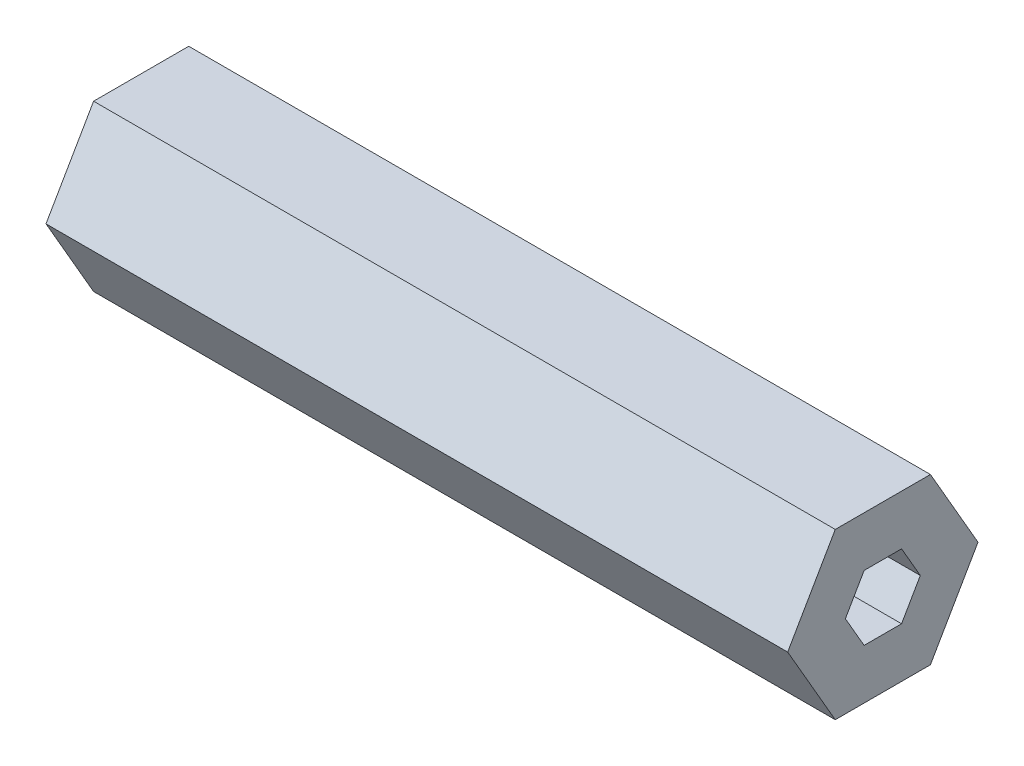
ISO-10303-21;
HEADER;
FILE_DESCRIPTION(('STEP AP214'),'2;1');
FILE_NAME('part.step','',(''),(''),'','','');
FILE_SCHEMA(('AUTOMOTIVE_DESIGN { 1 0 10303 214 1 1 1 1 }'));
ENDSEC;
DATA;
#1=APPLICATION_CONTEXT('core data for automotive mechanical design processes');
#2=APPLICATION_PROTOCOL_DEFINITION('international standard','automotive_design',2000,#1);
#3=PRODUCT_CONTEXT('',#1,'mechanical');
#4=PRODUCT('Part','Part','',(#3));
#5=PRODUCT_RELATED_PRODUCT_CATEGORY('part','',(#4));
#6=PRODUCT_DEFINITION_FORMATION('','',#4);
#7=PRODUCT_DEFINITION_CONTEXT('part definition',#1,'design');
#8=PRODUCT_DEFINITION('design','',#6,#7);
#9=PRODUCT_DEFINITION_SHAPE('','',#8);
#10=(LENGTH_UNIT() NAMED_UNIT(*) SI_UNIT(.MILLI.,.METRE.));
#11=(NAMED_UNIT(*) PLANE_ANGLE_UNIT() SI_UNIT($,.RADIAN.));
#12=(NAMED_UNIT(*) SI_UNIT($,.STERADIAN.) SOLID_ANGLE_UNIT());
#13=UNCERTAINTY_MEASURE_WITH_UNIT(LENGTH_MEASURE(1.E-05),#10,'distance_accuracy_value','');
#14=(GEOMETRIC_REPRESENTATION_CONTEXT(3) GLOBAL_UNCERTAINTY_ASSIGNED_CONTEXT((#13)) GLOBAL_UNIT_ASSIGNED_CONTEXT((#10,
#11,#12)) REPRESENTATION_CONTEXT('',''));
#15=CARTESIAN_POINT('',(0.,0.,0.));
#16=DIRECTION('',(0.,0.,1.));
#17=DIRECTION('',(1.,0.,0.));
#18=AXIS2_PLACEMENT_3D('',#15,#16,#17);
#19=CARTESIAN_POINT('',(57.15,0.,0.));
#20=DIRECTION('',(1.,0.,0.));
#21=DIRECTION('',(0.,0.,-1.));
#22=AXIS2_PLACEMENT_3D('',#19,#20,#21);
#23=PLANE('',#22);
#24=DIRECTION('',(0.,0.866025403784441,-0.499999999999995));
#25=VECTOR('',#24,1.);
#26=CARTESIAN_POINT('',(57.15,-6.34999999999996,-3.6661742093542));
#27=LINE('',#26,#25);
#28=CARTESIAN_POINT('',(57.15,-6.34999999999996,-3.6661742093542));
#29=VERTEX_POINT('',#28);
#30=CARTESIAN_POINT('',(57.15,0.,-7.33234841870825));
#31=VERTEX_POINT('',#30);
#32=EDGE_CURVE('E230',#29,#31,#27,.T.);
#33=ORIENTED_EDGE('',*,*,#32,.T.);
#34=DIRECTION('',(0.,0.866025403784438,0.500000000000001));
#35=VECTOR('',#34,1.);
#36=CARTESIAN_POINT('',(57.15,0.,-7.33234841870825));
#37=LINE('',#36,#35);
#38=CARTESIAN_POINT('',(57.15,6.35000000000001,-3.66617420935411));
#39=VERTEX_POINT('',#38);
#40=EDGE_CURVE('E234',#31,#39,#37,.T.);
#41=ORIENTED_EDGE('',*,*,#40,.T.);
#42=DIRECTION('',(0.,0.,1.));
#43=VECTOR('',#42,1.);
#44=CARTESIAN_POINT('',(57.15,6.35000000000001,-3.66617420935411));
#45=LINE('',#44,#43);
#46=CARTESIAN_POINT('',(57.15,6.34999999999999,3.66617420935416));
#47=VERTEX_POINT('',#46);
#48=EDGE_CURVE('E238',#39,#47,#45,.T.);
#49=ORIENTED_EDGE('',*,*,#48,.T.);
#50=DIRECTION('',(0.,-0.866025403784442,0.499999999999995));
#51=VECTOR('',#50,1.);
#52=CARTESIAN_POINT('',(57.15,6.34999999999999,3.66617420935416));
#53=LINE('',#52,#51);
#54=CARTESIAN_POINT('',(57.15,0.,7.33234841870825));
#55=VERTEX_POINT('',#54);
#56=EDGE_CURVE('E241',#47,#55,#53,.T.);
#57=ORIENTED_EDGE('',*,*,#56,.T.);
#58=DIRECTION('',(0.,-0.866025403784435,-0.500000000000007));
#59=VECTOR('',#58,1.);
#60=CARTESIAN_POINT('',(57.15,0.,7.33234841870825));
#61=LINE('',#60,#59);
#62=CARTESIAN_POINT('',(57.15,-6.35000000000004,3.66617420935407));
#63=VERTEX_POINT('',#62);
#64=EDGE_CURVE('E244',#55,#63,#61,.T.);
#65=ORIENTED_EDGE('',*,*,#64,.T.);
#66=DIRECTION('',(0.,0.,-1.));
#67=VECTOR('',#66,1.);
#68=CARTESIAN_POINT('',(57.15,-6.35000000000004,3.66617420935407));
#69=LINE('',#68,#67);
#70=EDGE_CURVE('E247',#63,#29,#69,.T.);
#71=ORIENTED_EDGE('',*,*,#70,.T.);
#72=EDGE_LOOP('',(#33,#41,#49,#57,#65,#71));
#73=FACE_BOUND('',#72,.T.);
#74=DIRECTION('',(0.,0.866025403784438,0.5));
#75=VECTOR('',#74,1.);
#76=CARTESIAN_POINT('',(57.15,0.,-2.88675134594813));
#77=LINE('',#76,#75);
#78=CARTESIAN_POINT('',(57.15,0.,-2.88675134594813));
#79=VERTEX_POINT('',#78);
#80=CARTESIAN_POINT('',(57.15,2.5,-1.44337567297406));
#81=VERTEX_POINT('',#80);
#82=EDGE_CURVE('E170',#79,#81,#77,.T.);
#83=ORIENTED_EDGE('',*,*,#82,.F.);
#84=DIRECTION('',(0.,0.866025403784439,-0.5));
#85=VECTOR('',#84,1.);
#86=CARTESIAN_POINT('',(57.15,-2.5,-1.44337567297407));
#87=LINE('',#86,#85);
#88=CARTESIAN_POINT('',(57.15,-2.5,-1.44337567297407));
#89=VERTEX_POINT('',#88);
#90=EDGE_CURVE('E161',#89,#79,#87,.T.);
#91=ORIENTED_EDGE('',*,*,#90,.F.);
#92=DIRECTION('',(0.,0.,-1.));
#93=VECTOR('',#92,1.);
#94=CARTESIAN_POINT('',(57.15,-2.5,1.44337567297406));
#95=LINE('',#94,#93);
#96=CARTESIAN_POINT('',(57.15,-2.5,1.44337567297406));
#97=VERTEX_POINT('',#96);
#98=EDGE_CURVE('E196',#97,#89,#95,.T.);
#99=ORIENTED_EDGE('',*,*,#98,.F.);
#100=DIRECTION('',(0.,-0.866025403784438,-0.5));
#101=VECTOR('',#100,1.);
#102=CARTESIAN_POINT('',(57.15,0.,2.88675134594813));
#103=LINE('',#102,#101);
#104=CARTESIAN_POINT('',(57.15,0.,2.88675134594813));
#105=VERTEX_POINT('',#104);
#106=EDGE_CURVE('E193',#105,#97,#103,.T.);
#107=ORIENTED_EDGE('',*,*,#106,.F.);
#108=DIRECTION('',(0.,-0.866025403784439,0.5));
#109=VECTOR('',#108,1.);
#110=CARTESIAN_POINT('',(57.15,2.5,1.44337567297406));
#111=LINE('',#110,#109);
#112=CARTESIAN_POINT('',(57.15,2.5,1.44337567297406));
#113=VERTEX_POINT('',#112);
#114=EDGE_CURVE('E188',#113,#105,#111,.T.);
#115=ORIENTED_EDGE('',*,*,#114,.F.);
#116=DIRECTION('',(0.,0.,1.));
#117=VECTOR('',#116,1.);
#118=CARTESIAN_POINT('',(57.15,2.5,-1.44337567297406));
#119=LINE('',#118,#117);
#120=EDGE_CURVE('E184',#81,#113,#119,.T.);
#121=ORIENTED_EDGE('',*,*,#120,.F.);
#122=EDGE_LOOP('',(#83,#91,#99,#107,#115,#121));
#123=FACE_BOUND('',#122,.T.);
#124=ADVANCED_FACE('F47',(#73,#123),#23,.T.);
#125=CARTESIAN_POINT('',(0.,0.,0.));
#126=DIRECTION('',(1.,0.,0.));
#127=DIRECTION('',(0.,0.,-1.));
#128=AXIS2_PLACEMENT_3D('',#125,#126,#127);
#129=PLANE('',#128);
#130=DIRECTION('',(0.,0.866025403784441,-0.499999999999995));
#131=VECTOR('',#130,1.);
#132=CARTESIAN_POINT('',(0.,-6.34999999999996,-3.6661742093542));
#133=LINE('',#132,#131);
#134=CARTESIAN_POINT('',(0.,-6.34999999999996,-3.6661742093542));
#135=VERTEX_POINT('',#134);
#136=CARTESIAN_POINT('',(0.,0.,-7.33234841870825));
#137=VERTEX_POINT('',#136);
#138=EDGE_CURVE('E179',#135,#137,#133,.T.);
#139=ORIENTED_EDGE('',*,*,#138,.F.);
#140=DIRECTION('',(0.,0.,-1.));
#141=VECTOR('',#140,1.);
#142=CARTESIAN_POINT('',(0.,-6.35000000000004,3.66617420935407));
#143=LINE('',#142,#141);
#144=CARTESIAN_POINT('',(0.,-6.35000000000004,3.66617420935407));
#145=VERTEX_POINT('',#144);
#146=EDGE_CURVE('E235',#145,#135,#143,.T.);
#147=ORIENTED_EDGE('',*,*,#146,.F.);
#148=DIRECTION('',(0.,-0.866025403784435,-0.500000000000007));
#149=VECTOR('',#148,1.);
#150=CARTESIAN_POINT('',(0.,0.,7.33234841870825));
#151=LINE('',#150,#149);
#152=CARTESIAN_POINT('',(0.,0.,7.33234841870825));
#153=VERTEX_POINT('',#152);
#154=EDGE_CURVE('E263',#153,#145,#151,.T.);
#155=ORIENTED_EDGE('',*,*,#154,.F.);
#156=DIRECTION('',(0.,-0.866025403784442,0.499999999999995));
#157=VECTOR('',#156,1.);
#158=CARTESIAN_POINT('',(0.,6.34999999999999,3.66617420935416));
#159=LINE('',#158,#157);
#160=CARTESIAN_POINT('',(0.,6.34999999999999,3.66617420935416));
#161=VERTEX_POINT('',#160);
#162=EDGE_CURVE('E260',#161,#153,#159,.T.);
#163=ORIENTED_EDGE('',*,*,#162,.F.);
#164=DIRECTION('',(0.,0.,1.));
#165=VECTOR('',#164,1.);
#166=CARTESIAN_POINT('',(0.,6.35000000000001,-3.66617420935411));
#167=LINE('',#166,#165);
#168=CARTESIAN_POINT('',(0.,6.35000000000001,-3.66617420935411));
#169=VERTEX_POINT('',#168);
#170=EDGE_CURVE('E257',#169,#161,#167,.T.);
#171=ORIENTED_EDGE('',*,*,#170,.F.);
#172=DIRECTION('',(0.,0.866025403784438,0.500000000000001));
#173=VECTOR('',#172,1.);
#174=CARTESIAN_POINT('',(0.,0.,-7.33234841870825));
#175=LINE('',#174,#173);
#176=EDGE_CURVE('E254',#137,#169,#175,.T.);
#177=ORIENTED_EDGE('',*,*,#176,.F.);
#178=EDGE_LOOP('',(#139,#147,#155,#163,#171,#177));
#179=FACE_BOUND('',#178,.T.);
#180=DIRECTION('',(0.,0.866025403784439,-0.5));
#181=VECTOR('',#180,1.);
#182=CARTESIAN_POINT('',(0.,-2.5,-1.44337567297407));
#183=LINE('',#182,#181);
#184=CARTESIAN_POINT('',(0.,-2.5,-1.44337567297407));
#185=VERTEX_POINT('',#184);
#186=CARTESIAN_POINT('',(0.,0.,-2.88675134594813));
#187=VERTEX_POINT('',#186);
#188=EDGE_CURVE('E77',#185,#187,#183,.T.);
#189=ORIENTED_EDGE('',*,*,#188,.T.);
#190=DIRECTION('',(0.,0.866025403784438,0.5));
#191=VECTOR('',#190,1.);
#192=CARTESIAN_POINT('',(0.,0.,-2.88675134594813));
#193=LINE('',#192,#191);
#194=CARTESIAN_POINT('',(0.,2.5,-1.44337567297406));
#195=VERTEX_POINT('',#194);
#196=EDGE_CURVE('E177',#187,#195,#193,.T.);
#197=ORIENTED_EDGE('',*,*,#196,.T.);
#198=DIRECTION('',(0.,0.,1.));
#199=VECTOR('',#198,1.);
#200=CARTESIAN_POINT('',(0.,2.5,-1.44337567297406));
#201=LINE('',#200,#199);
#202=CARTESIAN_POINT('',(0.,2.5,1.44337567297406));
#203=VERTEX_POINT('',#202);
#204=EDGE_CURVE('E203',#195,#203,#201,.T.);
#205=ORIENTED_EDGE('',*,*,#204,.T.);
#206=DIRECTION('',(0.,-0.866025403784439,0.5));
#207=VECTOR('',#206,1.);
#208=CARTESIAN_POINT('',(0.,2.5,1.44337567297406));
#209=LINE('',#208,#207);
#210=CARTESIAN_POINT('',(0.,0.,2.88675134594813));
#211=VERTEX_POINT('',#210);
#212=EDGE_CURVE('E207',#203,#211,#209,.T.);
#213=ORIENTED_EDGE('',*,*,#212,.T.);
#214=DIRECTION('',(0.,-0.866025403784438,-0.5));
#215=VECTOR('',#214,1.);
#216=CARTESIAN_POINT('',(0.,0.,2.88675134594813));
#217=LINE('',#216,#215);
#218=CARTESIAN_POINT('',(0.,-2.5,1.44337567297406));
#219=VERTEX_POINT('',#218);
#220=EDGE_CURVE('E211',#211,#219,#217,.T.);
#221=ORIENTED_EDGE('',*,*,#220,.T.);
#222=DIRECTION('',(0.,0.,-1.));
#223=VECTOR('',#222,1.);
#224=CARTESIAN_POINT('',(0.,-2.5,1.44337567297406));
#225=LINE('',#224,#223);
#226=EDGE_CURVE('E171',#219,#185,#225,.T.);
#227=ORIENTED_EDGE('',*,*,#226,.T.);
#228=EDGE_LOOP('',(#189,#197,#205,#213,#221,#227));
#229=FACE_BOUND('',#228,.T.);
#230=ADVANCED_FACE('F294',(#179,#229),#129,.F.);
#231=CARTESIAN_POINT('',(57.15,-6.34999999999996,-3.6661742093542));
#232=DIRECTION('',(0.,0.499999999999995,0.866025403784442));
#233=DIRECTION('',(0.,-0.866025403784442,0.499999999999995));
#234=AXIS2_PLACEMENT_3D('',#231,#232,#233);
#235=PLANE('',#234);
#236=ORIENTED_EDGE('',*,*,#138,.T.);
#237=DIRECTION('',(-1.,0.,0.));
#238=VECTOR('',#237,1.);
#239=CARTESIAN_POINT('',(57.15,0.,-7.33234841870825));
#240=LINE('',#239,#238);
#241=EDGE_CURVE('E11',#31,#137,#240,.T.);
#242=ORIENTED_EDGE('',*,*,#241,.F.);
#243=ORIENTED_EDGE('',*,*,#32,.F.);
#244=DIRECTION('',(-1.,0.,0.));
#245=VECTOR('',#244,1.);
#246=CARTESIAN_POINT('',(57.15,-6.34999999999996,-3.6661742093542));
#247=LINE('',#246,#245);
#248=EDGE_CURVE('E250',#29,#135,#247,.T.);
#249=ORIENTED_EDGE('',*,*,#248,.T.);
#250=EDGE_LOOP('',(#236,#242,#243,#249));
#251=FACE_BOUND('',#250,.T.);
#252=ADVANCED_FACE('F49',(#251),#235,.F.);
#253=CARTESIAN_POINT('',(57.15,0.,-7.33234841870825));
#254=DIRECTION('',(0.,-0.500000000000001,0.866025403784438));
#255=DIRECTION('',(0.,-0.866025403784438,-0.500000000000001));
#256=AXIS2_PLACEMENT_3D('',#253,#254,#255);
#257=PLANE('',#256);
#258=ORIENTED_EDGE('',*,*,#176,.T.);
#259=DIRECTION('',(-1.,0.,0.));
#260=VECTOR('',#259,1.);
#261=CARTESIAN_POINT('',(57.15,6.35000000000001,-3.66617420935411));
#262=LINE('',#261,#260);
#263=EDGE_CURVE('E56',#39,#169,#262,.T.);
#264=ORIENTED_EDGE('',*,*,#263,.F.);
#265=ORIENTED_EDGE('',*,*,#40,.F.);
#266=ORIENTED_EDGE('',*,*,#241,.T.);
#267=EDGE_LOOP('',(#258,#264,#265,#266));
#268=FACE_BOUND('',#267,.T.);
#269=ADVANCED_FACE('F311',(#268),#257,.F.);
#270=CARTESIAN_POINT('',(57.15,6.35000000000001,-3.66617420935411));
#271=DIRECTION('',(0.,-1.,0.));
#272=DIRECTION('',(0.,0.,-1.));
#273=AXIS2_PLACEMENT_3D('',#270,#271,#272);
#274=PLANE('',#273);
#275=ORIENTED_EDGE('',*,*,#170,.T.);
#276=DIRECTION('',(-1.,0.,0.));
#277=VECTOR('',#276,1.);
#278=CARTESIAN_POINT('',(57.15,6.34999999999999,3.66617420935416));
#279=LINE('',#278,#277);
#280=EDGE_CURVE('E279',#47,#161,#279,.T.);
#281=ORIENTED_EDGE('',*,*,#280,.F.);
#282=ORIENTED_EDGE('',*,*,#48,.F.);
#283=ORIENTED_EDGE('',*,*,#263,.T.);
#284=EDGE_LOOP('',(#275,#281,#282,#283));
#285=FACE_BOUND('',#284,.T.);
#286=ADVANCED_FACE('F288',(#285),#274,.F.);
#287=CARTESIAN_POINT('',(57.15,6.34999999999999,3.66617420935416));
#288=DIRECTION('',(0.,-0.499999999999995,-0.866025403784442));
#289=DIRECTION('',(0.,0.866025403784442,-0.499999999999995));
#290=AXIS2_PLACEMENT_3D('',#287,#288,#289);
#291=PLANE('',#290);
#292=ORIENTED_EDGE('',*,*,#162,.T.);
#293=DIRECTION('',(-1.,0.,0.));
#294=VECTOR('',#293,1.);
#295=CARTESIAN_POINT('',(57.15,0.,7.33234841870825));
#296=LINE('',#295,#294);
#297=EDGE_CURVE('E275',#55,#153,#296,.T.);
#298=ORIENTED_EDGE('',*,*,#297,.F.);
#299=ORIENTED_EDGE('',*,*,#56,.F.);
#300=ORIENTED_EDGE('',*,*,#280,.T.);
#301=EDGE_LOOP('',(#292,#298,#299,#300));
#302=FACE_BOUND('',#301,.T.);
#303=ADVANCED_FACE('F300',(#302),#291,.F.);
#304=CARTESIAN_POINT('',(57.15,0.,7.33234841870825));
#305=DIRECTION('',(0.,0.500000000000007,-0.866025403784435));
#306=DIRECTION('',(0.,0.866025403784435,0.500000000000007));
#307=AXIS2_PLACEMENT_3D('',#304,#305,#306);
#308=PLANE('',#307);
#309=ORIENTED_EDGE('',*,*,#154,.T.);
#310=DIRECTION('',(-1.,0.,0.));
#311=VECTOR('',#310,1.);
#312=CARTESIAN_POINT('',(57.15,-6.35000000000004,3.66617420935407));
#313=LINE('',#312,#311);
#314=EDGE_CURVE('E271',#63,#145,#313,.T.);
#315=ORIENTED_EDGE('',*,*,#314,.F.);
#316=ORIENTED_EDGE('',*,*,#64,.F.);
#317=ORIENTED_EDGE('',*,*,#297,.T.);
#318=EDGE_LOOP('',(#309,#315,#316,#317));
#319=FACE_BOUND('',#318,.T.);
#320=ADVANCED_FACE('F304',(#319),#308,.F.);
#321=CARTESIAN_POINT('',(57.15,-6.35000000000004,3.66617420935407));
#322=DIRECTION('',(0.,1.,0.));
#323=DIRECTION('',(0.,0.,1.));
#324=AXIS2_PLACEMENT_3D('',#321,#322,#323);
#325=PLANE('',#324);
#326=ORIENTED_EDGE('',*,*,#146,.T.);
#327=ORIENTED_EDGE('',*,*,#248,.F.);
#328=ORIENTED_EDGE('',*,*,#70,.F.);
#329=ORIENTED_EDGE('',*,*,#314,.T.);
#330=EDGE_LOOP('',(#326,#327,#328,#329));
#331=FACE_BOUND('',#330,.T.);
#332=ADVANCED_FACE('F314',(#331),#325,.F.);
#333=CARTESIAN_POINT('',(57.15,-2.5,-1.44337567297407));
#334=DIRECTION('',(0.,0.5,0.866025403784439));
#335=DIRECTION('',(0.,-0.866025403784439,0.5));
#336=AXIS2_PLACEMENT_3D('',#333,#334,#335);
#337=PLANE('',#336);
#338=ORIENTED_EDGE('',*,*,#188,.F.);
#339=DIRECTION('',(-1.,0.,0.));
#340=VECTOR('',#339,1.);
#341=CARTESIAN_POINT('',(57.15,-2.5,-1.44337567297407));
#342=LINE('',#341,#340);
#343=EDGE_CURVE('E165',#89,#185,#342,.T.);
#344=ORIENTED_EDGE('',*,*,#343,.F.);
#345=ORIENTED_EDGE('',*,*,#90,.T.);
#346=DIRECTION('',(-1.,0.,0.));
#347=VECTOR('',#346,1.);
#348=CARTESIAN_POINT('',(57.15,0.,-2.88675134594813));
#349=LINE('',#348,#347);
#350=EDGE_CURVE('E164',#79,#187,#349,.T.);
#351=ORIENTED_EDGE('',*,*,#350,.T.);
#352=EDGE_LOOP('',(#338,#344,#345,#351));
#353=FACE_BOUND('',#352,.T.);
#354=ADVANCED_FACE('F163',(#353),#337,.T.);
#355=CARTESIAN_POINT('',(57.15,0.,-2.88675134594813));
#356=DIRECTION('',(0.,-0.5,0.866025403784438));
#357=DIRECTION('',(0.,-0.866025403784439,-0.5));
#358=AXIS2_PLACEMENT_3D('',#355,#356,#357);
#359=PLANE('',#358);
#360=ORIENTED_EDGE('',*,*,#196,.F.);
#361=ORIENTED_EDGE('',*,*,#350,.F.);
#362=ORIENTED_EDGE('',*,*,#82,.T.);
#363=DIRECTION('',(-1.,0.,0.));
#364=VECTOR('',#363,1.);
#365=CARTESIAN_POINT('',(57.15,2.5,-1.44337567297406));
#366=LINE('',#365,#364);
#367=EDGE_CURVE('E180',#81,#195,#366,.T.);
#368=ORIENTED_EDGE('',*,*,#367,.T.);
#369=EDGE_LOOP('',(#360,#361,#362,#368));
#370=FACE_BOUND('',#369,.T.);
#371=ADVANCED_FACE('F174',(#370),#359,.T.);
#372=CARTESIAN_POINT('',(57.15,2.5,-1.44337567297406));
#373=DIRECTION('',(0.,-1.,0.));
#374=DIRECTION('',(0.,0.,-1.));
#375=AXIS2_PLACEMENT_3D('',#372,#373,#374);
#376=PLANE('',#375);
#377=ORIENTED_EDGE('',*,*,#204,.F.);
#378=ORIENTED_EDGE('',*,*,#367,.F.);
#379=ORIENTED_EDGE('',*,*,#120,.T.);
#380=DIRECTION('',(-1.,0.,0.));
#381=VECTOR('',#380,1.);
#382=CARTESIAN_POINT('',(57.15,2.5,1.44337567297406));
#383=LINE('',#382,#381);
#384=EDGE_CURVE('E225',#113,#203,#383,.T.);
#385=ORIENTED_EDGE('',*,*,#384,.T.);
#386=EDGE_LOOP('',(#377,#378,#379,#385));
#387=FACE_BOUND('',#386,.T.);
#388=ADVANCED_FACE('F333',(#387),#376,.T.);
#389=CARTESIAN_POINT('',(57.15,2.5,1.44337567297406));
#390=DIRECTION('',(0.,-0.5,-0.866025403784438));
#391=DIRECTION('',(0.,0.866025403784439,-0.5));
#392=AXIS2_PLACEMENT_3D('',#389,#390,#391);
#393=PLANE('',#392);
#394=ORIENTED_EDGE('',*,*,#212,.F.);
#395=ORIENTED_EDGE('',*,*,#384,.F.);
#396=ORIENTED_EDGE('',*,*,#114,.T.);
#397=DIRECTION('',(-1.,0.,0.));
#398=VECTOR('',#397,1.);
#399=CARTESIAN_POINT('',(57.15,0.,2.88675134594813));
#400=LINE('',#399,#398);
#401=EDGE_CURVE('E222',#105,#211,#400,.T.);
#402=ORIENTED_EDGE('',*,*,#401,.T.);
#403=EDGE_LOOP('',(#394,#395,#396,#402));
#404=FACE_BOUND('',#403,.T.);
#405=ADVANCED_FACE('F336',(#404),#393,.T.);
#406=CARTESIAN_POINT('',(57.15,0.,2.88675134594813));
#407=DIRECTION('',(0.,0.5,-0.866025403784438));
#408=DIRECTION('',(0.,0.866025403784439,0.5));
#409=AXIS2_PLACEMENT_3D('',#406,#407,#408);
#410=PLANE('',#409);
#411=ORIENTED_EDGE('',*,*,#220,.F.);
#412=ORIENTED_EDGE('',*,*,#401,.F.);
#413=ORIENTED_EDGE('',*,*,#106,.T.);
#414=DIRECTION('',(-1.,0.,0.));
#415=VECTOR('',#414,1.);
#416=CARTESIAN_POINT('',(57.15,-2.5,1.44337567297406));
#417=LINE('',#416,#415);
#418=EDGE_CURVE('E66',#97,#219,#417,.T.);
#419=ORIENTED_EDGE('',*,*,#418,.T.);
#420=EDGE_LOOP('',(#411,#412,#413,#419));
#421=FACE_BOUND('',#420,.T.);
#422=ADVANCED_FACE('F340',(#421),#410,.T.);
#423=CARTESIAN_POINT('',(57.15,-2.5,1.44337567297406));
#424=DIRECTION('',(0.,1.,0.));
#425=DIRECTION('',(0.,0.,1.));
#426=AXIS2_PLACEMENT_3D('',#423,#424,#425);
#427=PLANE('',#426);
#428=ORIENTED_EDGE('',*,*,#226,.F.);
#429=ORIENTED_EDGE('',*,*,#418,.F.);
#430=ORIENTED_EDGE('',*,*,#98,.T.);
#431=ORIENTED_EDGE('',*,*,#343,.T.);
#432=EDGE_LOOP('',(#428,#429,#430,#431));
#433=FACE_BOUND('',#432,.T.);
#434=ADVANCED_FACE('F344',(#433),#427,.T.);
#435=CLOSED_SHELL('',(#124,#230,#252,#269,#286,#303,#320,#332,#354,#371,#388,#405,#422,#434));
#436=MANIFOLD_SOLID_BREP('B2',#435);
#437=ADVANCED_BREP_SHAPE_REPRESENTATION('',(#18,#436),#14);
#438=SHAPE_DEFINITION_REPRESENTATION(#9,#437);
ENDSEC;
END-ISO-10303-21;
